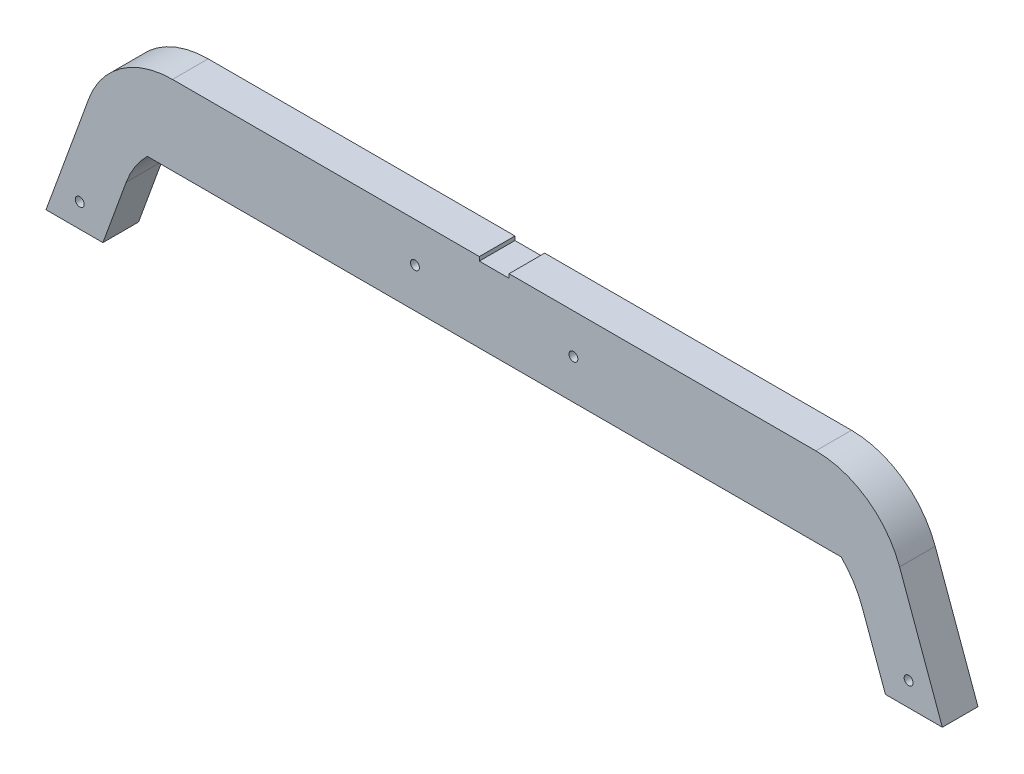
ISO-10303-21;
HEADER;
FILE_DESCRIPTION(('STEP AP214'),'2;1');
FILE_NAME('part.step','',(''),(''),'','','');
FILE_SCHEMA(('AUTOMOTIVE_DESIGN { 1 0 10303 214 1 1 1 1 }'));
ENDSEC;
DATA;
#1=APPLICATION_CONTEXT('core data for automotive mechanical design processes');
#2=APPLICATION_PROTOCOL_DEFINITION('international standard','automotive_design',2000,#1);
#3=PRODUCT_CONTEXT('',#1,'mechanical');
#4=PRODUCT('Part','Part','',(#3));
#5=PRODUCT_RELATED_PRODUCT_CATEGORY('part','',(#4));
#6=PRODUCT_DEFINITION_FORMATION('','',#4);
#7=PRODUCT_DEFINITION_CONTEXT('part definition',#1,'design');
#8=PRODUCT_DEFINITION('design','',#6,#7);
#9=PRODUCT_DEFINITION_SHAPE('','',#8);
#10=(LENGTH_UNIT() NAMED_UNIT(*) SI_UNIT(.MILLI.,.METRE.));
#11=(NAMED_UNIT(*) PLANE_ANGLE_UNIT() SI_UNIT($,.RADIAN.));
#12=(NAMED_UNIT(*) SI_UNIT($,.STERADIAN.) SOLID_ANGLE_UNIT());
#13=UNCERTAINTY_MEASURE_WITH_UNIT(LENGTH_MEASURE(1.E-05),#10,'distance_accuracy_value','');
#14=(GEOMETRIC_REPRESENTATION_CONTEXT(3) GLOBAL_UNCERTAINTY_ASSIGNED_CONTEXT((#13)) GLOBAL_UNIT_ASSIGNED_CONTEXT((#10,
#11,#12)) REPRESENTATION_CONTEXT('',''));
#15=CARTESIAN_POINT('',(0.,0.,0.));
#16=DIRECTION('',(0.,0.,1.));
#17=DIRECTION('',(1.,0.,0.));
#18=AXIS2_PLACEMENT_3D('',#15,#16,#17);
#19=CARTESIAN_POINT('',(-193.910377295628,166.679190243215,29.));
#20=DIRECTION('',(0.,-1.,0.));
#21=DIRECTION('',(0.,0.,-1.));
#22=AXIS2_PLACEMENT_3D('',#19,#20,#21);
#23=PLANE('',#22);
#24=DIRECTION('',(-1.,0.,0.));
#25=VECTOR('',#24,1.);
#26=CARTESIAN_POINT('',(-193.910377295628,166.679190243215,29.));
#27=LINE('',#26,#25);
#28=CARTESIAN_POINT('',(-7.5,166.679190243215,29.));
#29=VERTEX_POINT('',#28);
#30=CARTESIAN_POINT('',(-162.401038076192,166.679190243215,29.));
#31=VERTEX_POINT('',#30);
#32=EDGE_CURVE('E237',#29,#31,#27,.T.);
#33=ORIENTED_EDGE('',*,*,#32,.F.);
#34=DIRECTION('',(0.,0.,1.));
#35=VECTOR('',#34,1.);
#36=CARTESIAN_POINT('',(-7.5,166.679190243215,11.));
#37=LINE('',#36,#35);
#38=CARTESIAN_POINT('',(-7.5,166.679190243215,11.));
#39=VERTEX_POINT('',#38);
#40=EDGE_CURVE('E195',#39,#29,#37,.T.);
#41=ORIENTED_EDGE('',*,*,#40,.F.);
#42=DIRECTION('',(-1.,0.,0.));
#43=VECTOR('',#42,1.);
#44=CARTESIAN_POINT('',(-193.910377295628,166.679190243215,11.));
#45=LINE('',#44,#43);
#46=CARTESIAN_POINT('',(-162.401038076192,166.679190243215,11.));
#47=VERTEX_POINT('',#46);
#48=EDGE_CURVE('E177',#39,#47,#45,.T.);
#49=ORIENTED_EDGE('',*,*,#48,.T.);
#50=DIRECTION('',(0.,0.,-1.));
#51=VECTOR('',#50,1.);
#52=CARTESIAN_POINT('',(-162.401038076192,166.679190243215,29.));
#53=LINE('',#52,#51);
#54=EDGE_CURVE('E305',#47,#31,#53,.F.);
#55=ORIENTED_EDGE('',*,*,#54,.T.);
#56=EDGE_LOOP('',(#33,#41,#49,#55));
#57=FACE_BOUND('',#56,.T.);
#58=ADVANCED_FACE('F39',(#57),#23,.F.);
#59=CARTESIAN_POINT('',(-197.55,77.7366902432154,29.));
#60=DIRECTION('',(0.,1.,0.));
#61=DIRECTION('',(-1.,0.,0.));
#62=AXIS2_PLACEMENT_3D('',#59,#60,#61);
#63=PLANE('',#62);
#64=DIRECTION('',(1.,0.,0.));
#65=VECTOR('',#64,1.);
#66=CARTESIAN_POINT('',(-197.55,77.7366902432154,11.));
#67=LINE('',#66,#65);
#68=CARTESIAN_POINT('',(-226.28279985685,77.7366902432154,11.));
#69=VERTEX_POINT('',#68);
#70=CARTESIAN_POINT('',(-197.55,77.7366902432154,11.));
#71=VERTEX_POINT('',#70);
#72=EDGE_CURVE('E216',#69,#71,#67,.T.);
#73=ORIENTED_EDGE('',*,*,#72,.T.);
#74=DIRECTION('',(0.,0.,-1.));
#75=VECTOR('',#74,1.);
#76=CARTESIAN_POINT('',(-197.55,77.7366902432154,29.));
#77=LINE('',#76,#75);
#78=CARTESIAN_POINT('',(-197.55,77.7366902432154,29.));
#79=VERTEX_POINT('',#78);
#80=EDGE_CURVE('E280',#79,#71,#77,.T.);
#81=ORIENTED_EDGE('',*,*,#80,.F.);
#82=DIRECTION('',(1.,0.,0.));
#83=VECTOR('',#82,1.);
#84=CARTESIAN_POINT('',(-197.55,77.7366902432154,29.));
#85=LINE('',#84,#83);
#86=CARTESIAN_POINT('',(-226.28279985685,77.7366902432154,29.));
#87=VERTEX_POINT('',#86);
#88=EDGE_CURVE('E219',#87,#79,#85,.T.);
#89=ORIENTED_EDGE('',*,*,#88,.F.);
#90=DIRECTION('',(0.,0.,-1.));
#91=VECTOR('',#90,1.);
#92=CARTESIAN_POINT('',(-226.28279985685,77.7366902432154,29.));
#93=LINE('',#92,#91);
#94=EDGE_CURVE('E245',#87,#69,#93,.T.);
#95=ORIENTED_EDGE('',*,*,#94,.T.);
#96=EDGE_LOOP('',(#73,#81,#89,#95));
#97=FACE_BOUND('',#96,.T.);
#98=ADVANCED_FACE('F341',(#97),#63,.F.);
#99=CARTESIAN_POINT('',(-197.55,77.7366902432154,29.));
#100=DIRECTION('',(-0.939692620785909,0.342020143325666,0.));
#101=DIRECTION('',(-0.342020143325666,-0.939692620785909,0.));
#102=AXIS2_PLACEMENT_3D('',#99,#100,#101);
#103=PLANE('',#102);
#104=DIRECTION('',(0.342020143325666,0.939692620785909,0.));
#105=VECTOR('',#104,1.);
#106=CARTESIAN_POINT('',(-197.55,77.7366902432154,11.));
#107=LINE('',#106,#105);
#108=CARTESIAN_POINT('',(-185.781602479895,110.07009669287,11.));
#109=VERTEX_POINT('',#108);
#110=EDGE_CURVE('E249',#71,#109,#107,.T.);
#111=ORIENTED_EDGE('',*,*,#110,.T.);
#112=DIRECTION('',(0.,0.,-1.));
#113=VECTOR('',#112,1.);
#114=CARTESIAN_POINT('',(-185.781602479895,110.07009669287,29.));
#115=LINE('',#114,#113);
#116=CARTESIAN_POINT('',(-185.781602479895,110.07009669287,29.));
#117=VERTEX_POINT('',#116);
#118=EDGE_CURVE('E288',#109,#117,#115,.F.);
#119=ORIENTED_EDGE('',*,*,#118,.T.);
#120=DIRECTION('',(0.342020143325666,0.939692620785909,0.));
#121=VECTOR('',#120,1.);
#122=CARTESIAN_POINT('',(-197.55,77.7366902432154,29.));
#123=LINE('',#122,#121);
#124=EDGE_CURVE('E223',#79,#117,#123,.T.);
#125=ORIENTED_EDGE('',*,*,#124,.F.);
#126=ORIENTED_EDGE('',*,*,#80,.T.);
#127=EDGE_LOOP('',(#111,#119,#125,#126));
#128=FACE_BOUND('',#127,.T.);
#129=ADVANCED_FACE('F330',(#128),#103,.F.);
#130=CARTESIAN_POINT('',(197.55,77.7366902432155,29.));
#131=DIRECTION('',(0.939692620785909,0.342020143325667,0.));
#132=DIRECTION('',(-0.342020143325667,0.939692620785909,0.));
#133=AXIS2_PLACEMENT_3D('',#130,#131,#132);
#134=PLANE('',#133);
#135=DIRECTION('',(0.342020143325667,-0.939692620785909,0.));
#136=VECTOR('',#135,1.);
#137=CARTESIAN_POINT('',(197.55,77.7366902432155,29.));
#138=LINE('',#137,#136);
#139=CARTESIAN_POINT('',(185.781602479895,110.07009669287,29.));
#140=VERTEX_POINT('',#139);
#141=CARTESIAN_POINT('',(197.55,77.7366902432155,29.));
#142=VERTEX_POINT('',#141);
#143=EDGE_CURVE('E228',#140,#142,#138,.T.);
#144=ORIENTED_EDGE('',*,*,#143,.F.);
#145=DIRECTION('',(0.,0.,-1.));
#146=VECTOR('',#145,1.);
#147=CARTESIAN_POINT('',(185.781602479895,110.07009669287,11.));
#148=LINE('',#147,#146);
#149=CARTESIAN_POINT('',(185.781602479895,110.07009669287,11.));
#150=VERTEX_POINT('',#149);
#151=EDGE_CURVE('E284',#140,#150,#148,.T.);
#152=ORIENTED_EDGE('',*,*,#151,.T.);
#153=DIRECTION('',(0.342020143325667,-0.939692620785909,0.));
#154=VECTOR('',#153,1.);
#155=CARTESIAN_POINT('',(197.55,77.7366902432155,11.));
#156=LINE('',#155,#154);
#157=CARTESIAN_POINT('',(197.55,77.7366902432155,11.));
#158=VERTEX_POINT('',#157);
#159=EDGE_CURVE('E253',#150,#158,#156,.T.);
#160=ORIENTED_EDGE('',*,*,#159,.T.);
#161=DIRECTION('',(0.,0.,-1.));
#162=VECTOR('',#161,1.);
#163=CARTESIAN_POINT('',(197.55,77.7366902432155,29.));
#164=LINE('',#163,#162);
#165=EDGE_CURVE('E276',#142,#158,#164,.T.);
#166=ORIENTED_EDGE('',*,*,#165,.F.);
#167=EDGE_LOOP('',(#144,#152,#160,#166));
#168=FACE_BOUND('',#167,.T.);
#169=ADVANCED_FACE('F373',(#168),#134,.F.);
#170=CARTESIAN_POINT('',(197.55,77.7366902432155,29.));
#171=DIRECTION('',(0.,1.,0.));
#172=DIRECTION('',(-1.,0.,0.));
#173=AXIS2_PLACEMENT_3D('',#170,#171,#172);
#174=PLANE('',#173);
#175=DIRECTION('',(1.,0.,0.));
#176=VECTOR('',#175,1.);
#177=CARTESIAN_POINT('',(197.55,77.7366902432155,11.));
#178=LINE('',#177,#176);
#179=CARTESIAN_POINT('',(226.282799856849,77.7366902432154,11.));
#180=VERTEX_POINT('',#179);
#181=EDGE_CURVE('E256',#158,#180,#178,.T.);
#182=ORIENTED_EDGE('',*,*,#181,.T.);
#183=DIRECTION('',(0.,0.,-1.));
#184=VECTOR('',#183,1.);
#185=CARTESIAN_POINT('',(226.282799856849,77.7366902432154,29.));
#186=LINE('',#185,#184);
#187=CARTESIAN_POINT('',(226.282799856849,77.7366902432154,29.));
#188=VERTEX_POINT('',#187);
#189=EDGE_CURVE('E272',#188,#180,#186,.T.);
#190=ORIENTED_EDGE('',*,*,#189,.F.);
#191=DIRECTION('',(1.,0.,0.));
#192=VECTOR('',#191,1.);
#193=CARTESIAN_POINT('',(197.55,77.7366902432155,29.));
#194=LINE('',#193,#192);
#195=EDGE_CURVE('E231',#142,#188,#194,.T.);
#196=ORIENTED_EDGE('',*,*,#195,.F.);
#197=ORIENTED_EDGE('',*,*,#165,.T.);
#198=EDGE_LOOP('',(#182,#190,#196,#197));
#199=FACE_BOUND('',#198,.T.);
#200=ADVANCED_FACE('F370',(#199),#174,.F.);
#201=CARTESIAN_POINT('',(222.921700761219,86.9712341130085,29.));
#202=DIRECTION('',(-0.939692620785909,-0.342020143325667,0.));
#203=DIRECTION('',(0.342020143325667,-0.939692620785909,0.));
#204=AXIS2_PLACEMENT_3D('',#201,#202,#203);
#205=PLANE('',#204);
#206=DIRECTION('',(-0.342020143325667,0.939692620785909,0.));
#207=VECTOR('',#206,1.);
#208=CARTESIAN_POINT('',(222.921700761219,86.9712341130085,11.));
#209=LINE('',#208,#207);
#210=CARTESIAN_POINT('',(204.687206011557,137.07009669287,11.));
#211=VERTEX_POINT('',#210);
#212=EDGE_CURVE('E260',#180,#211,#209,.T.);
#213=ORIENTED_EDGE('',*,*,#212,.T.);
#214=DIRECTION('',(0.,0.,-1.));
#215=VECTOR('',#214,1.);
#216=CARTESIAN_POINT('',(204.687206011557,137.07009669287,29.));
#217=LINE('',#216,#215);
#218=CARTESIAN_POINT('',(204.687206011557,137.07009669287,29.));
#219=VERTEX_POINT('',#218);
#220=EDGE_CURVE('E63',#211,#219,#217,.F.);
#221=ORIENTED_EDGE('',*,*,#220,.T.);
#222=DIRECTION('',(-0.342020143325664,0.93969262078591,0.));
#223=VECTOR('',#222,1.);
#224=CARTESIAN_POINT('',(222.921700761219,86.9712341130085,29.));
#225=LINE('',#224,#223);
#226=EDGE_CURVE('E234',#188,#219,#225,.T.);
#227=ORIENTED_EDGE('',*,*,#226,.F.);
#228=ORIENTED_EDGE('',*,*,#189,.T.);
#229=EDGE_LOOP('',(#213,#221,#227,#228));
#230=FACE_BOUND('',#229,.T.);
#231=ADVANCED_FACE('F363',(#230),#205,.F.);
#232=CARTESIAN_POINT('',(162.401038076191,166.679190243215,11.));
#233=VERTEX_POINT('',#232);
#234=CARTESIAN_POINT('',(7.5,166.679190243215,11.));
#235=VERTEX_POINT('',#234);
#236=EDGE_CURVE('E263',#233,#235,#45,.T.);
#237=ORIENTED_EDGE('',*,*,#236,.T.);
#238=DIRECTION('',(0.,0.,1.));
#239=VECTOR('',#238,1.);
#240=CARTESIAN_POINT('',(7.5,166.679190243215,11.));
#241=LINE('',#240,#239);
#242=CARTESIAN_POINT('',(7.5,166.679190243215,29.));
#243=VERTEX_POINT('',#242);
#244=EDGE_CURVE('E199',#235,#243,#241,.T.);
#245=ORIENTED_EDGE('',*,*,#244,.T.);
#246=CARTESIAN_POINT('',(162.401038076191,166.679190243215,29.));
#247=VERTEX_POINT('',#246);
#248=EDGE_CURVE('E238',#247,#243,#27,.T.);
#249=ORIENTED_EDGE('',*,*,#248,.F.);
#250=DIRECTION('',(0.,0.,-1.));
#251=VECTOR('',#250,1.);
#252=CARTESIAN_POINT('',(162.401038076191,166.679190243215,29.));
#253=LINE('',#252,#251);
#254=EDGE_CURVE('E301',#247,#233,#253,.T.);
#255=ORIENTED_EDGE('',*,*,#254,.T.);
#256=EDGE_LOOP('',(#237,#245,#249,#255));
#257=FACE_BOUND('',#256,.T.);
#258=ADVANCED_FACE('F358',(#257),#23,.F.);
#259=CARTESIAN_POINT('',(-222.92170076122,86.9712341130084,29.));
#260=DIRECTION('',(0.939692620785911,-0.342020143325663,0.));
#261=DIRECTION('',(0.342020143325663,0.939692620785911,0.));
#262=AXIS2_PLACEMENT_3D('',#259,#260,#261);
#263=PLANE('',#262);
#264=DIRECTION('',(-0.342020143325666,-0.939692620785909,0.));
#265=VECTOR('',#264,1.);
#266=CARTESIAN_POINT('',(-222.92170076122,86.9712341130084,29.));
#267=LINE('',#266,#265);
#268=CARTESIAN_POINT('',(-204.687206011557,137.07009669287,29.));
#269=VERTEX_POINT('',#268);
#270=EDGE_CURVE('E242',#269,#87,#267,.T.);
#271=ORIENTED_EDGE('',*,*,#270,.F.);
#272=DIRECTION('',(0.,0.,-1.));
#273=VECTOR('',#272,1.);
#274=CARTESIAN_POINT('',(-204.687206011558,137.07009669287,29.));
#275=LINE('',#274,#273);
#276=CARTESIAN_POINT('',(-204.687206011558,137.07009669287,11.));
#277=VERTEX_POINT('',#276);
#278=EDGE_CURVE('E291',#269,#277,#275,.T.);
#279=ORIENTED_EDGE('',*,*,#278,.T.);
#280=DIRECTION('',(-0.342020143325663,-0.939692620785911,0.));
#281=VECTOR('',#280,1.);
#282=CARTESIAN_POINT('',(-222.92170076122,86.9712341130084,11.));
#283=LINE('',#282,#281);
#284=EDGE_CURVE('E224',#277,#69,#283,.T.);
#285=ORIENTED_EDGE('',*,*,#284,.T.);
#286=ORIENTED_EDGE('',*,*,#94,.F.);
#287=EDGE_LOOP('',(#271,#279,#285,#286));
#288=FACE_BOUND('',#287,.T.);
#289=ADVANCED_FACE('F345',(#288),#263,.F.);
#290=CARTESIAN_POINT('',(-2.41543681808807E-13,77.7366902432154,29.));
#291=DIRECTION('',(0.,0.,1.));
#292=DIRECTION('',(1.,0.,0.));
#293=AXIS2_PLACEMENT_3D('',#290,#291,#292);
#294=PLANE('',#293);
#295=CARTESIAN_POINT('',(-40.,146.679190243215,29.));
#296=DIRECTION('',(0.,0.,1.));
#297=DIRECTION('',(1.,0.,0.));
#298=AXIS2_PLACEMENT_3D('',#295,#296,#297);
#299=CIRCLE('',#298,2.25);
#300=CARTESIAN_POINT('',(-37.75,146.679190243215,29.));
#301=VERTEX_POINT('',#300);
#302=EDGE_CURVE('E534',#301,#301,#299,.T.);
#303=ORIENTED_EDGE('',*,*,#302,.F.);
#304=EDGE_LOOP('',(#303));
#305=FACE_BOUND('',#304,.T.);
#306=CARTESIAN_POINT('',(40.,146.679190243215,29.));
#307=DIRECTION('',(0.,0.,1.));
#308=DIRECTION('',(1.,0.,0.));
#309=AXIS2_PLACEMENT_3D('',#306,#307,#308);
#310=CIRCLE('',#309,2.25);
#311=CARTESIAN_POINT('',(42.25,146.679190243215,29.));
#312=VERTEX_POINT('',#311);
#313=EDGE_CURVE('E542',#312,#312,#310,.T.);
#314=ORIENTED_EDGE('',*,*,#313,.F.);
#315=EDGE_LOOP('',(#314));
#316=FACE_BOUND('',#315,.T.);
#317=CARTESIAN_POINT('',(209.25,89.7366902432155,29.));
#318=DIRECTION('',(0.,0.,1.));
#319=DIRECTION('',(1.,0.,0.));
#320=AXIS2_PLACEMENT_3D('',#317,#318,#319);
#321=CIRCLE('',#320,2.25000000000001);
#322=CARTESIAN_POINT('',(211.5,89.7366902432155,29.));
#323=VERTEX_POINT('',#322);
#324=EDGE_CURVE('E551',#323,#323,#321,.T.);
#325=ORIENTED_EDGE('',*,*,#324,.F.);
#326=EDGE_LOOP('',(#325));
#327=FACE_BOUND('',#326,.T.);
#328=CARTESIAN_POINT('',(-209.25,89.7366902432154,29.));
#329=DIRECTION('',(0.,0.,1.));
#330=DIRECTION('',(-1.,0.,0.));
#331=AXIS2_PLACEMENT_3D('',#328,#329,#330);
#332=CIRCLE('',#331,2.25000000000001);
#333=CARTESIAN_POINT('',(-211.5,89.7366902432154,29.));
#334=VERTEX_POINT('',#333);
#335=EDGE_CURVE('E185',#334,#334,#332,.T.);
#336=ORIENTED_EDGE('',*,*,#335,.F.);
#337=EDGE_LOOP('',(#336));
#338=FACE_BOUND('',#337,.T.);
#339=DIRECTION('',(0.,-1.,0.));
#340=VECTOR('',#339,1.);
#341=CARTESIAN_POINT('',(-7.5,164.679190243215,29.));
#342=LINE('',#341,#340);
#343=CARTESIAN_POINT('',(-7.5,164.679190243215,29.));
#344=VERTEX_POINT('',#343);
#345=EDGE_CURVE('E161',#29,#344,#342,.T.);
#346=ORIENTED_EDGE('',*,*,#345,.F.);
#347=ORIENTED_EDGE('',*,*,#32,.T.);
#348=CARTESIAN_POINT('',(-162.401038076192,121.679190243215,29.));
#349=DIRECTION('',(0.,0.,1.));
#350=DIRECTION('',(1.,0.,0.));
#351=AXIS2_PLACEMENT_3D('',#348,#349,#350);
#352=CIRCLE('',#351,45.);
#353=EDGE_CURVE('E312',#31,#269,#352,.T.);
#354=ORIENTED_EDGE('',*,*,#353,.T.);
#355=ORIENTED_EDGE('',*,*,#270,.T.);
#356=ORIENTED_EDGE('',*,*,#88,.T.);
#357=ORIENTED_EDGE('',*,*,#124,.T.);
#358=CARTESIAN_POINT('',(-143.495434544529,94.6791902432154,29.));
#359=DIRECTION('',(0.,0.,1.));
#360=DIRECTION('',(1.,0.,0.));
#361=AXIS2_PLACEMENT_3D('',#358,#359,#360);
#362=CIRCLE('',#361,45.);
#363=CARTESIAN_POINT('',(-175.134018583642,126.679190243215,29.));
#364=VERTEX_POINT('',#363);
#365=EDGE_CURVE('E11',#117,#364,#362,.F.);
#366=ORIENTED_EDGE('',*,*,#365,.T.);
#367=DIRECTION('',(1.,0.,0.));
#368=VECTOR('',#367,1.);
#369=CARTESIAN_POINT('',(111.856850505416,126.679190243215,29.));
#370=LINE('',#369,#368);
#371=CARTESIAN_POINT('',(175.134018583641,126.679190243215,29.));
#372=VERTEX_POINT('',#371);
#373=EDGE_CURVE('E198',#364,#372,#370,.T.);
#374=ORIENTED_EDGE('',*,*,#373,.T.);
#375=CARTESIAN_POINT('',(143.495434544529,94.6791902432154,29.));
#376=DIRECTION('',(0.,0.,1.));
#377=DIRECTION('',(1.,0.,0.));
#378=AXIS2_PLACEMENT_3D('',#375,#376,#377);
#379=CIRCLE('',#378,45.);
#380=EDGE_CURVE('E321',#372,#140,#379,.F.);
#381=ORIENTED_EDGE('',*,*,#380,.T.);
#382=ORIENTED_EDGE('',*,*,#143,.T.);
#383=ORIENTED_EDGE('',*,*,#195,.T.);
#384=ORIENTED_EDGE('',*,*,#226,.T.);
#385=CARTESIAN_POINT('',(162.401038076191,121.679190243215,29.));
#386=DIRECTION('',(0.,0.,1.));
#387=DIRECTION('',(1.,0.,0.));
#388=AXIS2_PLACEMENT_3D('',#385,#386,#387);
#389=CIRCLE('',#388,45.);
#390=EDGE_CURVE('E309',#219,#247,#389,.T.);
#391=ORIENTED_EDGE('',*,*,#390,.T.);
#392=ORIENTED_EDGE('',*,*,#248,.T.);
#393=DIRECTION('',(0.,1.,0.));
#394=VECTOR('',#393,1.);
#395=CARTESIAN_POINT('',(7.5,164.679190243215,29.));
#396=LINE('',#395,#394);
#397=CARTESIAN_POINT('',(7.5,164.679190243215,29.));
#398=VERTEX_POINT('',#397);
#399=EDGE_CURVE('E179',#398,#243,#396,.T.);
#400=ORIENTED_EDGE('',*,*,#399,.F.);
#401=DIRECTION('',(1.,0.,0.));
#402=VECTOR('',#401,1.);
#403=CARTESIAN_POINT('',(-7.5,164.679190243215,29.));
#404=LINE('',#403,#402);
#405=EDGE_CURVE('E182',#344,#398,#404,.T.);
#406=ORIENTED_EDGE('',*,*,#405,.F.);
#407=EDGE_LOOP('',(#346,#347,#354,#355,#356,#357,#366,#374,#381,#382,#383,#384,#391,#392,#400,#406));
#408=FACE_BOUND('',#407,.T.);
#409=ADVANCED_FACE('F335',(#305,#316,#327,#338,#408),#294,.T.);
#410=CARTESIAN_POINT('',(-2.41543681808807E-13,77.7366902432154,11.));
#411=DIRECTION('',(0.,0.,1.));
#412=DIRECTION('',(1.,0.,0.));
#413=AXIS2_PLACEMENT_3D('',#410,#411,#412);
#414=PLANE('',#413);
#415=CARTESIAN_POINT('',(-40.,146.679190243215,11.));
#416=DIRECTION('',(0.,0.,1.));
#417=DIRECTION('',(1.,0.,0.));
#418=AXIS2_PLACEMENT_3D('',#415,#416,#417);
#419=CIRCLE('',#418,2.25);
#420=CARTESIAN_POINT('',(-37.75,146.679190243215,11.));
#421=VERTEX_POINT('',#420);
#422=EDGE_CURVE('E531',#421,#421,#419,.T.);
#423=ORIENTED_EDGE('',*,*,#422,.T.);
#424=EDGE_LOOP('',(#423));
#425=FACE_BOUND('',#424,.T.);
#426=CARTESIAN_POINT('',(40.,146.679190243215,11.));
#427=DIRECTION('',(0.,0.,1.));
#428=DIRECTION('',(1.,0.,0.));
#429=AXIS2_PLACEMENT_3D('',#426,#427,#428);
#430=CIRCLE('',#429,2.25);
#431=CARTESIAN_POINT('',(42.25,146.679190243215,11.));
#432=VERTEX_POINT('',#431);
#433=EDGE_CURVE('E536',#432,#432,#430,.T.);
#434=ORIENTED_EDGE('',*,*,#433,.T.);
#435=EDGE_LOOP('',(#434));
#436=FACE_BOUND('',#435,.T.);
#437=CARTESIAN_POINT('',(209.25,89.7366902432155,11.));
#438=DIRECTION('',(0.,0.,1.));
#439=DIRECTION('',(1.,0.,0.));
#440=AXIS2_PLACEMENT_3D('',#437,#438,#439);
#441=CIRCLE('',#440,2.25000000000001);
#442=CARTESIAN_POINT('',(211.5,89.7366902432155,11.));
#443=VERTEX_POINT('',#442);
#444=EDGE_CURVE('E192',#443,#443,#441,.T.);
#445=ORIENTED_EDGE('',*,*,#444,.T.);
#446=EDGE_LOOP('',(#445));
#447=FACE_BOUND('',#446,.T.);
#448=CARTESIAN_POINT('',(-209.25,89.7366902432154,11.));
#449=DIRECTION('',(0.,0.,1.));
#450=DIRECTION('',(-1.,0.,0.));
#451=AXIS2_PLACEMENT_3D('',#448,#449,#450);
#452=CIRCLE('',#451,2.25000000000001);
#453=CARTESIAN_POINT('',(-211.5,89.7366902432154,11.));
#454=VERTEX_POINT('',#453);
#455=EDGE_CURVE('E554',#454,#454,#452,.T.);
#456=ORIENTED_EDGE('',*,*,#455,.T.);
#457=EDGE_LOOP('',(#456));
#458=FACE_BOUND('',#457,.T.);
#459=ORIENTED_EDGE('',*,*,#48,.F.);
#460=DIRECTION('',(0.,-1.,0.));
#461=VECTOR('',#460,1.);
#462=CARTESIAN_POINT('',(-7.5,164.679190243215,11.));
#463=LINE('',#462,#461);
#464=CARTESIAN_POINT('',(-7.5,164.679190243215,11.));
#465=VERTEX_POINT('',#464);
#466=EDGE_CURVE('E158',#39,#465,#463,.T.);
#467=ORIENTED_EDGE('',*,*,#466,.T.);
#468=DIRECTION('',(1.,0.,0.));
#469=VECTOR('',#468,1.);
#470=CARTESIAN_POINT('',(-7.5,164.679190243215,11.));
#471=LINE('',#470,#469);
#472=CARTESIAN_POINT('',(7.5,164.679190243215,11.));
#473=VERTEX_POINT('',#472);
#474=EDGE_CURVE('E169',#465,#473,#471,.T.);
#475=ORIENTED_EDGE('',*,*,#474,.T.);
#476=DIRECTION('',(0.,1.,0.));
#477=VECTOR('',#476,1.);
#478=CARTESIAN_POINT('',(7.5,164.679190243215,11.));
#479=LINE('',#478,#477);
#480=EDGE_CURVE('E55',#473,#235,#479,.T.);
#481=ORIENTED_EDGE('',*,*,#480,.T.);
#482=ORIENTED_EDGE('',*,*,#236,.F.);
#483=CARTESIAN_POINT('',(162.401038076191,121.679190243215,11.));
#484=DIRECTION('',(0.,0.,1.));
#485=DIRECTION('',(1.,0.,0.));
#486=AXIS2_PLACEMENT_3D('',#483,#484,#485);
#487=CIRCLE('',#486,45.);
#488=EDGE_CURVE('E295',#233,#211,#487,.F.);
#489=ORIENTED_EDGE('',*,*,#488,.T.);
#490=ORIENTED_EDGE('',*,*,#212,.F.);
#491=ORIENTED_EDGE('',*,*,#181,.F.);
#492=ORIENTED_EDGE('',*,*,#159,.F.);
#493=CARTESIAN_POINT('',(143.495434544529,94.6791902432154,11.));
#494=DIRECTION('',(0.,0.,1.));
#495=DIRECTION('',(1.,0.,0.));
#496=AXIS2_PLACEMENT_3D('',#493,#494,#495);
#497=CIRCLE('',#496,45.);
#498=CARTESIAN_POINT('',(175.134018583641,126.679190243215,11.));
#499=VERTEX_POINT('',#498);
#500=EDGE_CURVE('E317',#150,#499,#497,.T.);
#501=ORIENTED_EDGE('',*,*,#500,.T.);
#502=DIRECTION('',(1.,0.,0.));
#503=VECTOR('',#502,1.);
#504=CARTESIAN_POINT('',(-111.856850505416,126.679190243215,11.));
#505=LINE('',#504,#503);
#506=CARTESIAN_POINT('',(-175.134018583642,126.679190243215,11.));
#507=VERTEX_POINT('',#506);
#508=EDGE_CURVE('E205',#507,#499,#505,.T.);
#509=ORIENTED_EDGE('',*,*,#508,.F.);
#510=CARTESIAN_POINT('',(-143.495434544529,94.6791902432154,11.));
#511=DIRECTION('',(0.,0.,1.));
#512=DIRECTION('',(1.,0.,0.));
#513=AXIS2_PLACEMENT_3D('',#510,#511,#512);
#514=CIRCLE('',#513,45.);
#515=EDGE_CURVE('E48',#507,#109,#514,.T.);
#516=ORIENTED_EDGE('',*,*,#515,.T.);
#517=ORIENTED_EDGE('',*,*,#110,.F.);
#518=ORIENTED_EDGE('',*,*,#72,.F.);
#519=ORIENTED_EDGE('',*,*,#284,.F.);
#520=CARTESIAN_POINT('',(-162.401038076192,121.679190243215,11.));
#521=DIRECTION('',(0.,0.,1.));
#522=DIRECTION('',(1.,0.,0.));
#523=AXIS2_PLACEMENT_3D('',#520,#521,#522);
#524=CIRCLE('',#523,45.);
#525=EDGE_CURVE('E298',#277,#47,#524,.F.);
#526=ORIENTED_EDGE('',*,*,#525,.T.);
#527=EDGE_LOOP('',(#459,#467,#475,#481,#482,#489,#490,#491,#492,#501,#509,#516,#517,#518,#519,#526));
#528=FACE_BOUND('',#527,.T.);
#529=ADVANCED_FACE('F175',(#425,#436,#447,#458,#528),#414,.F.);
#530=CARTESIAN_POINT('',(143.495434544529,94.6791902432154,29.));
#531=DIRECTION('',(0.,0.,1.));
#532=DIRECTION('',(1.,0.,0.));
#533=AXIS2_PLACEMENT_3D('',#530,#531,#532);
#534=CYLINDRICAL_SURFACE('',#533,45.);
#535=ORIENTED_EDGE('',*,*,#380,.F.);
#536=DIRECTION('',(0.,0.,1.));
#537=VECTOR('',#536,1.);
#538=CARTESIAN_POINT('',(175.134018583641,126.679190243215,11.));
#539=LINE('',#538,#537);
#540=EDGE_CURVE('E208',#499,#372,#539,.T.);
#541=ORIENTED_EDGE('',*,*,#540,.F.);
#542=ORIENTED_EDGE('',*,*,#500,.F.);
#543=ORIENTED_EDGE('',*,*,#151,.F.);
#544=EDGE_LOOP('',(#535,#541,#542,#543));
#545=FACE_BOUND('',#544,.T.);
#546=ADVANCED_FACE('F376',(#545),#534,.F.);
#547=CARTESIAN_POINT('',(-143.495434544529,94.6791902432154,29.));
#548=DIRECTION('',(0.,0.,1.));
#549=DIRECTION('',(1.,0.,0.));
#550=AXIS2_PLACEMENT_3D('',#547,#548,#549);
#551=CYLINDRICAL_SURFACE('',#550,45.);
#552=ORIENTED_EDGE('',*,*,#515,.F.);
#553=DIRECTION('',(0.,0.,1.));
#554=VECTOR('',#553,1.);
#555=CARTESIAN_POINT('',(-175.134018583642,126.679190243215,11.));
#556=LINE('',#555,#554);
#557=EDGE_CURVE('E212',#507,#364,#556,.T.);
#558=ORIENTED_EDGE('',*,*,#557,.T.);
#559=ORIENTED_EDGE('',*,*,#365,.F.);
#560=ORIENTED_EDGE('',*,*,#118,.F.);
#561=EDGE_LOOP('',(#552,#558,#559,#560));
#562=FACE_BOUND('',#561,.T.);
#563=ADVANCED_FACE('F333',(#562),#551,.F.);
#564=CARTESIAN_POINT('',(-162.401038076192,121.679190243215,29.));
#565=DIRECTION('',(0.,0.,-1.));
#566=DIRECTION('',(-1.,0.,0.));
#567=AXIS2_PLACEMENT_3D('',#564,#565,#566);
#568=CYLINDRICAL_SURFACE('',#567,45.);
#569=ORIENTED_EDGE('',*,*,#353,.F.);
#570=ORIENTED_EDGE('',*,*,#54,.F.);
#571=ORIENTED_EDGE('',*,*,#525,.F.);
#572=ORIENTED_EDGE('',*,*,#278,.F.);
#573=EDGE_LOOP('',(#569,#570,#571,#572));
#574=FACE_BOUND('',#573,.T.);
#575=ADVANCED_FACE('F349',(#574),#568,.T.);
#576=CARTESIAN_POINT('',(162.401038076191,121.679190243215,29.));
#577=DIRECTION('',(0.,0.,-1.));
#578=DIRECTION('',(-1.,0.,0.));
#579=AXIS2_PLACEMENT_3D('',#576,#577,#578);
#580=CYLINDRICAL_SURFACE('',#579,45.);
#581=ORIENTED_EDGE('',*,*,#390,.F.);
#582=ORIENTED_EDGE('',*,*,#220,.F.);
#583=ORIENTED_EDGE('',*,*,#488,.F.);
#584=ORIENTED_EDGE('',*,*,#254,.F.);
#585=EDGE_LOOP('',(#581,#582,#583,#584));
#586=FACE_BOUND('',#585,.T.);
#587=ADVANCED_FACE('F41',(#586),#580,.T.);
#588=CARTESIAN_POINT('',(111.856850505416,126.679190243215,11.));
#589=DIRECTION('',(0.,-1.,0.));
#590=DIRECTION('',(0.,0.,-1.));
#591=AXIS2_PLACEMENT_3D('',#588,#589,#590);
#592=PLANE('',#591);
#593=ORIENTED_EDGE('',*,*,#373,.F.);
#594=ORIENTED_EDGE('',*,*,#557,.F.);
#595=ORIENTED_EDGE('',*,*,#508,.T.);
#596=ORIENTED_EDGE('',*,*,#540,.T.);
#597=EDGE_LOOP('',(#593,#594,#595,#596));
#598=FACE_BOUND('',#597,.T.);
#599=ADVANCED_FACE('F379',(#598),#592,.T.);
#600=CARTESIAN_POINT('',(-7.5,164.679190243215,11.));
#601=DIRECTION('',(-1.,0.,0.));
#602=DIRECTION('',(0.,0.,1.));
#603=AXIS2_PLACEMENT_3D('',#600,#601,#602);
#604=PLANE('',#603);
#605=ORIENTED_EDGE('',*,*,#345,.T.);
#606=DIRECTION('',(0.,0.,1.));
#607=VECTOR('',#606,1.);
#608=CARTESIAN_POINT('',(-7.5,164.679190243215,11.));
#609=LINE('',#608,#607);
#610=EDGE_CURVE('E154',#465,#344,#609,.T.);
#611=ORIENTED_EDGE('',*,*,#610,.F.);
#612=ORIENTED_EDGE('',*,*,#466,.F.);
#613=ORIENTED_EDGE('',*,*,#40,.T.);
#614=EDGE_LOOP('',(#605,#611,#612,#613));
#615=FACE_BOUND('',#614,.T.);
#616=ADVANCED_FACE('F156',(#615),#604,.F.);
#617=CARTESIAN_POINT('',(7.5,164.679190243215,11.));
#618=DIRECTION('',(1.,0.,0.));
#619=DIRECTION('',(0.,0.,-1.));
#620=AXIS2_PLACEMENT_3D('',#617,#618,#619);
#621=PLANE('',#620);
#622=ORIENTED_EDGE('',*,*,#399,.T.);
#623=ORIENTED_EDGE('',*,*,#244,.F.);
#624=ORIENTED_EDGE('',*,*,#480,.F.);
#625=DIRECTION('',(0.,0.,1.));
#626=VECTOR('',#625,1.);
#627=CARTESIAN_POINT('',(7.5,164.679190243215,11.));
#628=LINE('',#627,#626);
#629=EDGE_CURVE('E166',#473,#398,#628,.T.);
#630=ORIENTED_EDGE('',*,*,#629,.T.);
#631=EDGE_LOOP('',(#622,#623,#624,#630));
#632=FACE_BOUND('',#631,.T.);
#633=ADVANCED_FACE('F356',(#632),#621,.F.);
#634=CARTESIAN_POINT('',(-7.5,164.679190243215,11.));
#635=DIRECTION('',(0.,-1.,0.));
#636=DIRECTION('',(1.,0.,0.));
#637=AXIS2_PLACEMENT_3D('',#634,#635,#636);
#638=PLANE('',#637);
#639=ORIENTED_EDGE('',*,*,#405,.T.);
#640=ORIENTED_EDGE('',*,*,#629,.F.);
#641=ORIENTED_EDGE('',*,*,#474,.F.);
#642=ORIENTED_EDGE('',*,*,#610,.T.);
#643=EDGE_LOOP('',(#639,#640,#641,#642));
#644=FACE_BOUND('',#643,.T.);
#645=ADVANCED_FACE('F170',(#644),#638,.F.);
#646=CARTESIAN_POINT('',(-209.25,89.7366902432154,11.));
#647=DIRECTION('',(0.,0.,1.));
#648=DIRECTION('',(1.,0.,0.));
#649=AXIS2_PLACEMENT_3D('',#646,#647,#648);
#650=CYLINDRICAL_SURFACE('',#649,2.25000000000001);
#651=ORIENTED_EDGE('',*,*,#455,.F.);
#652=EDGE_LOOP('',(#651));
#653=FACE_BOUND('',#652,.T.);
#654=ORIENTED_EDGE('',*,*,#335,.T.);
#655=EDGE_LOOP('',(#654));
#656=FACE_BOUND('',#655,.T.);
#657=ADVANCED_FACE('F474',(#653,#656),#650,.F.);
#658=CARTESIAN_POINT('',(209.25,89.7366902432155,11.));
#659=DIRECTION('',(0.,0.,1.));
#660=DIRECTION('',(1.,0.,0.));
#661=AXIS2_PLACEMENT_3D('',#658,#659,#660);
#662=CYLINDRICAL_SURFACE('',#661,2.25000000000001);
#663=ORIENTED_EDGE('',*,*,#444,.F.);
#664=EDGE_LOOP('',(#663));
#665=FACE_BOUND('',#664,.T.);
#666=ORIENTED_EDGE('',*,*,#324,.T.);
#667=EDGE_LOOP('',(#666));
#668=FACE_BOUND('',#667,.T.);
#669=ADVANCED_FACE('F483',(#665,#668),#662,.F.);
#670=CARTESIAN_POINT('',(40.,146.679190243215,11.));
#671=DIRECTION('',(0.,0.,1.));
#672=DIRECTION('',(1.,0.,0.));
#673=AXIS2_PLACEMENT_3D('',#670,#671,#672);
#674=CYLINDRICAL_SURFACE('',#673,2.25);
#675=ORIENTED_EDGE('',*,*,#433,.F.);
#676=EDGE_LOOP('',(#675));
#677=FACE_BOUND('',#676,.T.);
#678=ORIENTED_EDGE('',*,*,#313,.T.);
#679=EDGE_LOOP('',(#678));
#680=FACE_BOUND('',#679,.T.);
#681=ADVANCED_FACE('F493',(#677,#680),#674,.F.);
#682=CARTESIAN_POINT('',(-40.,146.679190243215,11.));
#683=DIRECTION('',(0.,0.,1.));
#684=DIRECTION('',(1.,0.,0.));
#685=AXIS2_PLACEMENT_3D('',#682,#683,#684);
#686=CYLINDRICAL_SURFACE('',#685,2.25);
#687=ORIENTED_EDGE('',*,*,#422,.F.);
#688=EDGE_LOOP('',(#687));
#689=FACE_BOUND('',#688,.T.);
#690=ORIENTED_EDGE('',*,*,#302,.T.);
#691=EDGE_LOOP('',(#690));
#692=FACE_BOUND('',#691,.T.);
#693=ADVANCED_FACE('F514',(#689,#692),#686,.F.);
#694=CLOSED_SHELL('',(#58,#98,#129,#169,#200,#231,#258,#289,#409,#529,#546,#563,#575,#587,#599,
#616,#633,#645,#657,#669,#681,#693));
#695=MANIFOLD_SOLID_BREP('B2',#694);
#696=ADVANCED_BREP_SHAPE_REPRESENTATION('',(#18,#695),#14);
#697=SHAPE_DEFINITION_REPRESENTATION(#9,#696);
ENDSEC;
END-ISO-10303-21;
